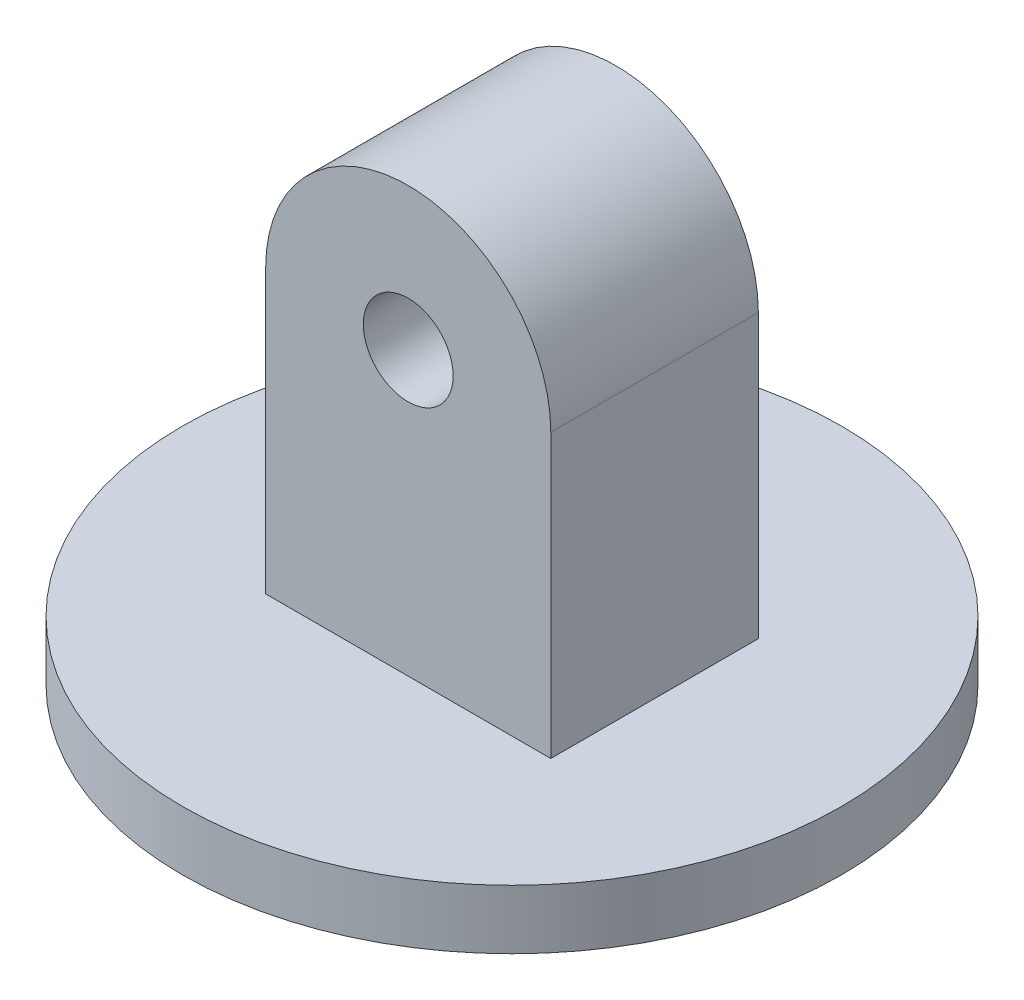
ISO-10303-21;
HEADER;
FILE_DESCRIPTION(('STEP AP214'),'2;1');
FILE_NAME('part.step','',(''),(''),'','','');
FILE_SCHEMA(('AUTOMOTIVE_DESIGN { 1 0 10303 214 1 1 1 1 }'));
ENDSEC;
DATA;
#1=APPLICATION_CONTEXT('core data for automotive mechanical design processes');
#2=APPLICATION_PROTOCOL_DEFINITION('international standard','automotive_design',2000,#1);
#3=PRODUCT_CONTEXT('',#1,'mechanical');
#4=PRODUCT('Part','Part','',(#3));
#5=PRODUCT_RELATED_PRODUCT_CATEGORY('part','',(#4));
#6=PRODUCT_DEFINITION_FORMATION('','',#4);
#7=PRODUCT_DEFINITION_CONTEXT('part definition',#1,'design');
#8=PRODUCT_DEFINITION('design','',#6,#7);
#9=PRODUCT_DEFINITION_SHAPE('','',#8);
#10=(LENGTH_UNIT() NAMED_UNIT(*) SI_UNIT(.MILLI.,.METRE.));
#11=(NAMED_UNIT(*) PLANE_ANGLE_UNIT() SI_UNIT($,.RADIAN.));
#12=(NAMED_UNIT(*) SI_UNIT($,.STERADIAN.) SOLID_ANGLE_UNIT());
#13=UNCERTAINTY_MEASURE_WITH_UNIT(LENGTH_MEASURE(1.E-05),#10,'distance_accuracy_value','');
#14=(GEOMETRIC_REPRESENTATION_CONTEXT(3) GLOBAL_UNCERTAINTY_ASSIGNED_CONTEXT((#13)) GLOBAL_UNIT_ASSIGNED_CONTEXT((#10,
#11,#12)) REPRESENTATION_CONTEXT('',''));
#15=CARTESIAN_POINT('',(0.,0.,0.));
#16=DIRECTION('',(0.,0.,1.));
#17=DIRECTION('',(1.,0.,0.));
#18=AXIS2_PLACEMENT_3D('',#15,#16,#17);
#19=CARTESIAN_POINT('',(9.6161256127451,0.,14.));
#20=DIRECTION('',(-1.,0.,0.));
#21=DIRECTION('',(0.,0.,1.));
#22=AXIS2_PLACEMENT_3D('',#19,#20,#21);
#23=PLANE('',#22);
#24=DIRECTION('',(0.,1.,0.));
#25=VECTOR('',#24,1.);
#26=CARTESIAN_POINT('',(9.6161256127451,0.,0.));
#27=LINE('',#26,#25);
#28=CARTESIAN_POINT('',(9.6161256127451,-19.05,0.));
#29=VERTEX_POINT('',#28);
#30=CARTESIAN_POINT('',(9.6161256127451,0.,0.));
#31=VERTEX_POINT('',#30);
#32=EDGE_CURVE('E66',#29,#31,#27,.T.);
#33=ORIENTED_EDGE('',*,*,#32,.T.);
#34=DIRECTION('',(0.,0.,-1.));
#35=VECTOR('',#34,1.);
#36=CARTESIAN_POINT('',(9.6161256127451,0.,14.));
#37=LINE('',#36,#35);
#38=CARTESIAN_POINT('',(9.6161256127451,0.,14.));
#39=VERTEX_POINT('',#38);
#40=EDGE_CURVE('E44',#39,#31,#37,.T.);
#41=ORIENTED_EDGE('',*,*,#40,.F.);
#42=DIRECTION('',(0.,1.,0.));
#43=VECTOR('',#42,1.);
#44=CARTESIAN_POINT('',(9.6161256127451,0.,14.));
#45=LINE('',#44,#43);
#46=CARTESIAN_POINT('',(9.6161256127451,-19.05,14.));
#47=VERTEX_POINT('',#46);
#48=EDGE_CURVE('E76',#47,#39,#45,.T.);
#49=ORIENTED_EDGE('',*,*,#48,.F.);
#50=DIRECTION('',(0.,0.,-1.));
#51=VECTOR('',#50,1.);
#52=CARTESIAN_POINT('',(9.6161256127451,-19.05,14.));
#53=LINE('',#52,#51);
#54=EDGE_CURVE('E11',#47,#29,#53,.T.);
#55=ORIENTED_EDGE('',*,*,#54,.T.);
#56=EDGE_LOOP('',(#33,#41,#49,#55));
#57=FACE_BOUND('',#56,.T.);
#58=ADVANCED_FACE('F36',(#57),#23,.F.);
#59=CARTESIAN_POINT('',(0.,0.,14.));
#60=DIRECTION('',(0.,0.,-1.));
#61=DIRECTION('',(-1.,0.,0.));
#62=AXIS2_PLACEMENT_3D('',#59,#60,#61);
#63=CYLINDRICAL_SURFACE('',#62,9.6161256127451);
#64=CARTESIAN_POINT('',(0.,0.,0.));
#65=DIRECTION('',(0.,0.,1.));
#66=DIRECTION('',(1.,0.,0.));
#67=AXIS2_PLACEMENT_3D('',#64,#65,#66);
#68=CIRCLE('',#67,9.6161256127451);
#69=CARTESIAN_POINT('',(-9.6161256127451,0.,0.));
#70=VERTEX_POINT('',#69);
#71=EDGE_CURVE('E86',#31,#70,#68,.T.);
#72=ORIENTED_EDGE('',*,*,#71,.T.);
#73=DIRECTION('',(0.,0.,-1.));
#74=VECTOR('',#73,1.);
#75=CARTESIAN_POINT('',(-9.6161256127451,0.,14.));
#76=LINE('',#75,#74);
#77=CARTESIAN_POINT('',(-9.6161256127451,0.,14.));
#78=VERTEX_POINT('',#77);
#79=EDGE_CURVE('E71',#78,#70,#76,.T.);
#80=ORIENTED_EDGE('',*,*,#79,.F.);
#81=CARTESIAN_POINT('',(0.,0.,14.));
#82=DIRECTION('',(0.,0.,1.));
#83=DIRECTION('',(1.,0.,0.));
#84=AXIS2_PLACEMENT_3D('',#81,#82,#83);
#85=CIRCLE('',#84,9.6161256127451);
#86=EDGE_CURVE('E109',#39,#78,#85,.T.);
#87=ORIENTED_EDGE('',*,*,#86,.F.);
#88=ORIENTED_EDGE('',*,*,#40,.T.);
#89=EDGE_LOOP('',(#72,#80,#87,#88));
#90=FACE_BOUND('',#89,.T.);
#91=ADVANCED_FACE('F108',(#90),#63,.T.);
#92=CARTESIAN_POINT('',(-9.6161256127451,0.,14.));
#93=DIRECTION('',(-1.,0.,0.));
#94=DIRECTION('',(0.,0.,1.));
#95=AXIS2_PLACEMENT_3D('',#92,#93,#94);
#96=PLANE('',#95);
#97=DIRECTION('',(0.,1.,0.));
#98=VECTOR('',#97,1.);
#99=CARTESIAN_POINT('',(-9.6161256127451,0.,0.));
#100=LINE('',#99,#98);
#101=CARTESIAN_POINT('',(-9.6161256127451,-19.05,0.));
#102=VERTEX_POINT('',#101);
#103=EDGE_CURVE('E80',#102,#70,#100,.T.);
#104=ORIENTED_EDGE('',*,*,#103,.F.);
#105=DIRECTION('',(0.,0.,-1.));
#106=VECTOR('',#105,1.);
#107=CARTESIAN_POINT('',(-9.6161256127451,-19.05,14.));
#108=LINE('',#107,#106);
#109=CARTESIAN_POINT('',(-9.6161256127451,-19.05,14.));
#110=VERTEX_POINT('',#109);
#111=EDGE_CURVE('E52',#110,#102,#108,.T.);
#112=ORIENTED_EDGE('',*,*,#111,.F.);
#113=DIRECTION('',(0.,1.,0.));
#114=VECTOR('',#113,1.);
#115=CARTESIAN_POINT('',(-9.6161256127451,0.,14.));
#116=LINE('',#115,#114);
#117=EDGE_CURVE('E103',#110,#78,#116,.T.);
#118=ORIENTED_EDGE('',*,*,#117,.T.);
#119=ORIENTED_EDGE('',*,*,#79,.T.);
#120=EDGE_LOOP('',(#104,#112,#118,#119));
#121=FACE_BOUND('',#120,.T.);
#122=ADVANCED_FACE('F82',(#121),#96,.T.);
#123=CARTESIAN_POINT('',(0.,0.,14.));
#124=DIRECTION('',(0.,0.,-1.));
#125=DIRECTION('',(-1.,0.,0.));
#126=AXIS2_PLACEMENT_3D('',#123,#124,#125);
#127=CYLINDRICAL_SURFACE('',#126,3.02870098039216);
#128=CARTESIAN_POINT('',(0.,0.,14.));
#129=DIRECTION('',(0.,0.,1.));
#130=DIRECTION('',(1.,0.,0.));
#131=AXIS2_PLACEMENT_3D('',#128,#129,#130);
#132=CIRCLE('',#131,3.02870098039216);
#133=CARTESIAN_POINT('',(3.02870098039216,0.,14.));
#134=VERTEX_POINT('',#133);
#135=EDGE_CURVE('E99',#134,#134,#132,.T.);
#136=ORIENTED_EDGE('',*,*,#135,.T.);
#137=EDGE_LOOP('',(#136));
#138=FACE_BOUND('',#137,.T.);
#139=CARTESIAN_POINT('',(0.,0.,0.));
#140=DIRECTION('',(0.,0.,1.));
#141=DIRECTION('',(1.,0.,0.));
#142=AXIS2_PLACEMENT_3D('',#139,#140,#141);
#143=CIRCLE('',#142,3.02870098039216);
#144=CARTESIAN_POINT('',(3.02870098039216,0.,0.));
#145=VERTEX_POINT('',#144);
#146=EDGE_CURVE('E85',#145,#145,#143,.T.);
#147=ORIENTED_EDGE('',*,*,#146,.F.);
#148=EDGE_LOOP('',(#147));
#149=FACE_BOUND('',#148,.T.);
#150=ADVANCED_FACE('F159',(#138,#149),#127,.F.);
#151=CARTESIAN_POINT('',(0.,0.,14.));
#152=DIRECTION('',(0.,0.,1.));
#153=DIRECTION('',(1.,0.,0.));
#154=AXIS2_PLACEMENT_3D('',#151,#152,#153);
#155=PLANE('',#154);
#156=DIRECTION('',(-1.,0.,0.));
#157=VECTOR('',#156,1.);
#158=CARTESIAN_POINT('',(0.,-19.05,14.));
#159=LINE('',#158,#157);
#160=EDGE_CURVE('E98',#47,#110,#159,.T.);
#161=ORIENTED_EDGE('',*,*,#160,.F.);
#162=ORIENTED_EDGE('',*,*,#48,.T.);
#163=ORIENTED_EDGE('',*,*,#86,.T.);
#164=ORIENTED_EDGE('',*,*,#117,.F.);
#165=EDGE_LOOP('',(#161,#162,#163,#164));
#166=FACE_BOUND('',#165,.T.);
#167=ORIENTED_EDGE('',*,*,#135,.F.);
#168=EDGE_LOOP('',(#167));
#169=FACE_BOUND('',#168,.T.);
#170=ADVANCED_FACE('F164',(#166,#169),#155,.T.);
#171=CARTESIAN_POINT('',(0.,0.,0.));
#172=DIRECTION('',(0.,0.,1.));
#173=DIRECTION('',(1.,0.,0.));
#174=AXIS2_PLACEMENT_3D('',#171,#172,#173);
#175=PLANE('',#174);
#176=DIRECTION('',(-1.,0.,0.));
#177=VECTOR('',#176,1.);
#178=CARTESIAN_POINT('',(0.,-19.05,0.));
#179=LINE('',#178,#177);
#180=EDGE_CURVE('E89',#29,#102,#179,.T.);
#181=ORIENTED_EDGE('',*,*,#180,.T.);
#182=ORIENTED_EDGE('',*,*,#103,.T.);
#183=ORIENTED_EDGE('',*,*,#71,.F.);
#184=ORIENTED_EDGE('',*,*,#32,.F.);
#185=EDGE_LOOP('',(#181,#182,#183,#184));
#186=FACE_BOUND('',#185,.T.);
#187=ORIENTED_EDGE('',*,*,#146,.T.);
#188=EDGE_LOOP('',(#187));
#189=FACE_BOUND('',#188,.T.);
#190=ADVANCED_FACE('F90',(#186,#189),#175,.F.);
#191=CARTESIAN_POINT('',(0.,-19.05,7.));
#192=DIRECTION('',(0.,1.,0.));
#193=DIRECTION('',(0.,0.,1.));
#194=AXIS2_PLACEMENT_3D('',#191,#192,#193);
#195=PLANE('',#194);
#196=CARTESIAN_POINT('',(0.,-19.05,7.));
#197=DIRECTION('',(0.,-1.,0.));
#198=DIRECTION('',(0.,0.,-1.));
#199=AXIS2_PLACEMENT_3D('',#196,#197,#198);
#200=CIRCLE('',#199,22.225);
#201=CARTESIAN_POINT('',(0.,-19.05,-15.225));
#202=VERTEX_POINT('',#201);
#203=EDGE_CURVE('E94',#202,#202,#200,.T.);
#204=ORIENTED_EDGE('',*,*,#203,.F.);
#205=EDGE_LOOP('',(#204));
#206=FACE_BOUND('',#205,.T.);
#207=ORIENTED_EDGE('',*,*,#180,.F.);
#208=ORIENTED_EDGE('',*,*,#54,.F.);
#209=ORIENTED_EDGE('',*,*,#160,.T.);
#210=ORIENTED_EDGE('',*,*,#111,.T.);
#211=EDGE_LOOP('',(#207,#208,#209,#210));
#212=FACE_BOUND('',#211,.T.);
#213=ADVANCED_FACE('F97',(#206,#212),#195,.T.);
#214=CARTESIAN_POINT('',(0.,-23.05,7.));
#215=DIRECTION('',(0.,-1.,0.));
#216=DIRECTION('',(0.,0.,-1.));
#217=AXIS2_PLACEMENT_3D('',#214,#215,#216);
#218=CYLINDRICAL_SURFACE('',#217,22.225);
#219=ORIENTED_EDGE('',*,*,#203,.T.);
#220=EDGE_LOOP('',(#219));
#221=FACE_BOUND('',#220,.T.);
#222=CARTESIAN_POINT('',(0.,-23.05,7.));
#223=DIRECTION('',(0.,-1.,0.));
#224=DIRECTION('',(0.,0.,-1.));
#225=AXIS2_PLACEMENT_3D('',#222,#223,#224);
#226=CIRCLE('',#225,22.225);
#227=CARTESIAN_POINT('',(0.,-23.05,-15.225));
#228=VERTEX_POINT('',#227);
#229=EDGE_CURVE('E119',#228,#228,#226,.T.);
#230=ORIENTED_EDGE('',*,*,#229,.F.);
#231=EDGE_LOOP('',(#230));
#232=FACE_BOUND('',#231,.T.);
#233=ADVANCED_FACE('F140',(#221,#232),#218,.T.);
#234=CARTESIAN_POINT('',(0.,-23.05,-15.225));
#235=DIRECTION('',(0.,-1.,0.));
#236=DIRECTION('',(0.,0.,-1.));
#237=AXIS2_PLACEMENT_3D('',#234,#235,#236);
#238=PLANE('',#237);
#239=CARTESIAN_POINT('',(0.,-23.05,7.));
#240=DIRECTION('',(0.,-1.,0.));
#241=DIRECTION('',(0.,0.,-1.));
#242=AXIS2_PLACEMENT_3D('',#239,#240,#241);
#243=CIRCLE('',#242,3.175);
#244=CARTESIAN_POINT('',(0.,-23.05,3.825));
#245=VERTEX_POINT('',#244);
#246=EDGE_CURVE('E123',#245,#245,#243,.T.);
#247=ORIENTED_EDGE('',*,*,#246,.F.);
#248=EDGE_LOOP('',(#247));
#249=FACE_BOUND('',#248,.T.);
#250=ORIENTED_EDGE('',*,*,#229,.T.);
#251=EDGE_LOOP('',(#250));
#252=FACE_BOUND('',#251,.T.);
#253=ADVANCED_FACE('F134',(#249,#252),#238,.T.);
#254=CARTESIAN_POINT('',(0.,-19.05,7.));
#255=DIRECTION('',(0.,-1.,0.));
#256=DIRECTION('',(0.,0.,-1.));
#257=AXIS2_PLACEMENT_3D('',#254,#255,#256);
#258=CYLINDRICAL_SURFACE('',#257,3.175);
#259=CARTESIAN_POINT('',(0.,-19.05,7.));
#260=DIRECTION('',(0.,-1.,0.));
#261=DIRECTION('',(0.,0.,-1.));
#262=AXIS2_PLACEMENT_3D('',#259,#260,#261);
#263=CIRCLE('',#262,3.175);
#264=CARTESIAN_POINT('',(0.,-19.05,3.825));
#265=VERTEX_POINT('',#264);
#266=EDGE_CURVE('E122',#265,#265,#263,.T.);
#267=ORIENTED_EDGE('',*,*,#266,.F.);
#268=EDGE_LOOP('',(#267));
#269=FACE_BOUND('',#268,.T.);
#270=ORIENTED_EDGE('',*,*,#246,.T.);
#271=EDGE_LOOP('',(#270));
#272=FACE_BOUND('',#271,.T.);
#273=ADVANCED_FACE('F131',(#269,#272),#258,.F.);
#274=CARTESIAN_POINT('',(0.,-19.05,0.));
#275=DIRECTION('',(0.,-1.,0.));
#276=DIRECTION('',(0.,0.,-1.));
#277=AXIS2_PLACEMENT_3D('',#274,#275,#276);
#278=PLANE('',#277);
#279=ORIENTED_EDGE('',*,*,#266,.T.);
#280=EDGE_LOOP('',(#279));
#281=FACE_BOUND('',#280,.T.);
#282=ADVANCED_FACE('F129',(#281),#278,.T.);
#283=CLOSED_SHELL('',(#58,#91,#122,#150,#170,#190,#213,#233,#253,#273,#282));
#284=MANIFOLD_SOLID_BREP('B2',#283);
#285=ADVANCED_BREP_SHAPE_REPRESENTATION('',(#18,#284),#14);
#286=SHAPE_DEFINITION_REPRESENTATION(#9,#285);
ENDSEC;
END-ISO-10303-21;
